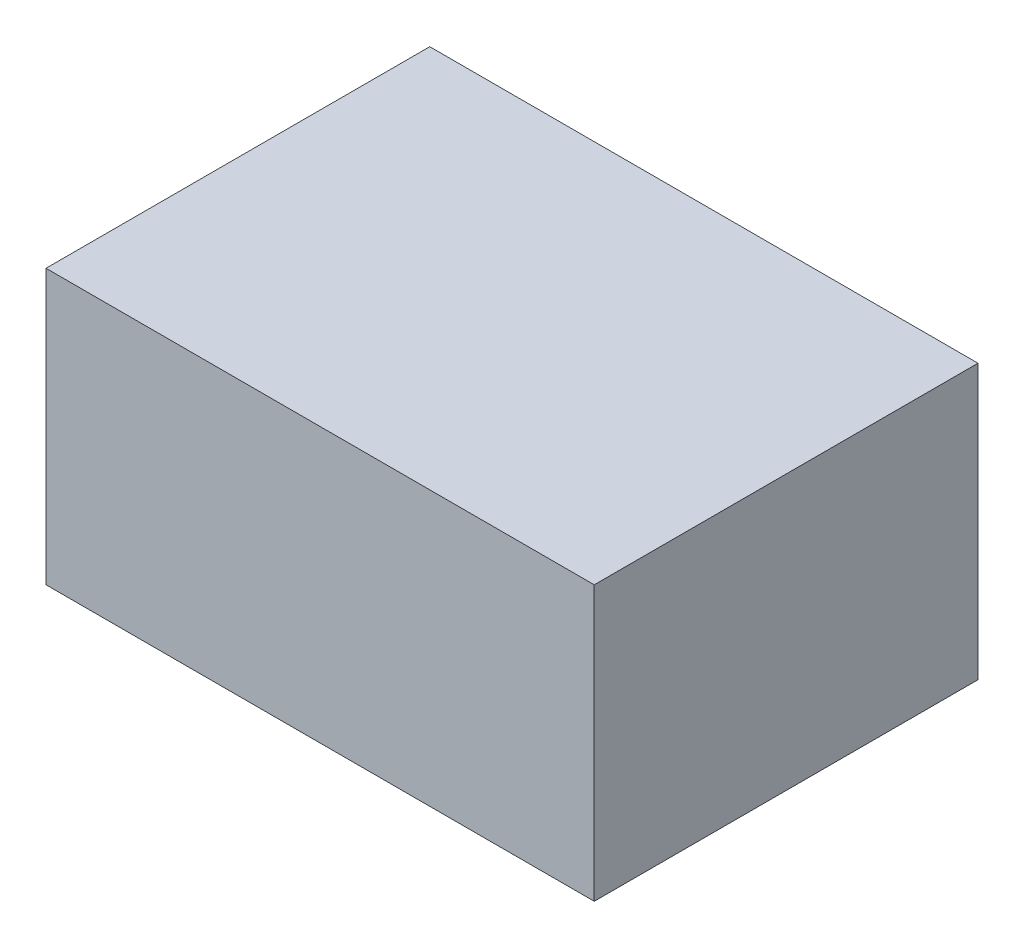
ISO-10303-21;
HEADER;
FILE_DESCRIPTION(('STEP AP214'),'2;1');
FILE_NAME('part.step','',(''),(''),'','','');
FILE_SCHEMA(('AUTOMOTIVE_DESIGN { 1 0 10303 214 1 1 1 1 }'));
ENDSEC;
DATA;
#1=APPLICATION_CONTEXT('core data for automotive mechanical design processes');
#2=APPLICATION_PROTOCOL_DEFINITION('international standard','automotive_design',2000,#1);
#3=PRODUCT_CONTEXT('',#1,'mechanical');
#4=PRODUCT('Part','Part','',(#3));
#5=PRODUCT_RELATED_PRODUCT_CATEGORY('part','',(#4));
#6=PRODUCT_DEFINITION_FORMATION('','',#4);
#7=PRODUCT_DEFINITION_CONTEXT('part definition',#1,'design');
#8=PRODUCT_DEFINITION('design','',#6,#7);
#9=PRODUCT_DEFINITION_SHAPE('','',#8);
#10=(LENGTH_UNIT() NAMED_UNIT(*) SI_UNIT(.MILLI.,.METRE.));
#11=(NAMED_UNIT(*) PLANE_ANGLE_UNIT() SI_UNIT($,.RADIAN.));
#12=(NAMED_UNIT(*) SI_UNIT($,.STERADIAN.) SOLID_ANGLE_UNIT());
#13=UNCERTAINTY_MEASURE_WITH_UNIT(LENGTH_MEASURE(1.E-05),#10,'distance_accuracy_value','');
#14=(GEOMETRIC_REPRESENTATION_CONTEXT(3) GLOBAL_UNCERTAINTY_ASSIGNED_CONTEXT((#13)) GLOBAL_UNIT_ASSIGNED_CONTEXT((#10,
#11,#12)) REPRESENTATION_CONTEXT('',''));
#15=CARTESIAN_POINT('',(0.,0.,0.));
#16=DIRECTION('',(0.,0.,1.));
#17=DIRECTION('',(1.,0.,0.));
#18=AXIS2_PLACEMENT_3D('',#15,#16,#17);
#19=CARTESIAN_POINT('',(0.2499995,0.12500102,0.));
#20=DIRECTION('',(0.,-1.,0.));
#21=DIRECTION('',(0.,0.,-1.));
#22=AXIS2_PLACEMENT_3D('',#19,#20,#21);
#23=PLANE('',#22);
#24=DIRECTION('',(0.,0.,-1.));
#25=VECTOR('',#24,1.);
#26=CARTESIAN_POINT('',(-0.2499995,0.12500102,0.));
#27=LINE('',#26,#25);
#28=CARTESIAN_POINT('',(-0.2499995,0.12500102,0.));
#29=VERTEX_POINT('',#28);
#30=CARTESIAN_POINT('',(-0.2499995,0.12500102,0.3499993));
#31=VERTEX_POINT('',#30);
#32=EDGE_CURVE('E20',#29,#31,#27,.F.);
#33=ORIENTED_EDGE('',*,*,#32,.T.);
#34=DIRECTION('',(-1.,0.,0.));
#35=VECTOR('',#34,1.);
#36=CARTESIAN_POINT('',(-0.2499995,0.12500102,0.3499993));
#37=LINE('',#36,#35);
#38=CARTESIAN_POINT('',(0.2499995,0.12500102,0.3499993));
#39=VERTEX_POINT('',#38);
#40=EDGE_CURVE('E55',#31,#39,#37,.F.);
#41=ORIENTED_EDGE('',*,*,#40,.T.);
#42=DIRECTION('',(0.,0.,1.));
#43=VECTOR('',#42,1.);
#44=CARTESIAN_POINT('',(0.2499995,0.12500102,0.));
#45=LINE('',#44,#43);
#46=CARTESIAN_POINT('',(0.2499995,0.12500102,0.));
#47=VERTEX_POINT('',#46);
#48=EDGE_CURVE('E76',#39,#47,#45,.F.);
#49=ORIENTED_EDGE('',*,*,#48,.T.);
#50=DIRECTION('',(-1.,0.,0.));
#51=VECTOR('',#50,1.);
#52=CARTESIAN_POINT('',(-0.2499995,0.12500102,0.));
#53=LINE('',#52,#51);
#54=EDGE_CURVE('E58',#29,#47,#53,.F.);
#55=ORIENTED_EDGE('',*,*,#54,.F.);
#56=EDGE_LOOP('',(#33,#41,#49,#55));
#57=FACE_BOUND('',#56,.T.);
#58=ADVANCED_FACE('F17',(#57),#23,.F.);
#59=CARTESIAN_POINT('',(-0.2499995,0.12500102,0.));
#60=DIRECTION('',(1.,0.,0.));
#61=DIRECTION('',(0.,0.,-1.));
#62=AXIS2_PLACEMENT_3D('',#59,#60,#61);
#63=PLANE('',#62);
#64=DIRECTION('',(0.,0.,1.));
#65=VECTOR('',#64,1.);
#66=CARTESIAN_POINT('',(-0.2499995,-0.12499848,0.));
#67=LINE('',#66,#65);
#68=CARTESIAN_POINT('',(-0.2499995,-0.12499848,0.));
#69=VERTEX_POINT('',#68);
#70=CARTESIAN_POINT('',(-0.2499995,-0.12499848,0.3499993));
#71=VERTEX_POINT('',#70);
#72=EDGE_CURVE('E73',#69,#71,#67,.T.);
#73=ORIENTED_EDGE('',*,*,#72,.T.);
#74=DIRECTION('',(0.,1.,0.));
#75=VECTOR('',#74,1.);
#76=CARTESIAN_POINT('',(-0.2499995,-0.12499848,0.3499993));
#77=LINE('',#76,#75);
#78=EDGE_CURVE('E63',#71,#31,#77,.T.);
#79=ORIENTED_EDGE('',*,*,#78,.T.);
#80=ORIENTED_EDGE('',*,*,#32,.F.);
#81=DIRECTION('',(0.,1.,0.));
#82=VECTOR('',#81,1.);
#83=CARTESIAN_POINT('',(-0.2499995,-0.12499848,0.));
#84=LINE('',#83,#82);
#85=EDGE_CURVE('E78',#69,#29,#84,.T.);
#86=ORIENTED_EDGE('',*,*,#85,.F.);
#87=EDGE_LOOP('',(#73,#79,#80,#86));
#88=FACE_BOUND('',#87,.T.);
#89=ADVANCED_FACE('F72',(#88),#63,.F.);
#90=CARTESIAN_POINT('',(-0.2499995,-0.12499848,0.3499993));
#91=DIRECTION('',(0.,0.,-1.));
#92=DIRECTION('',(-1.,0.,0.));
#93=AXIS2_PLACEMENT_3D('',#90,#91,#92);
#94=PLANE('',#93);
#95=DIRECTION('',(0.,1.,0.));
#96=VECTOR('',#95,1.);
#97=CARTESIAN_POINT('',(0.2499995,-0.12499848,0.3499993));
#98=LINE('',#97,#96);
#99=CARTESIAN_POINT('',(0.2499995,-0.12499848,0.3499993));
#100=VERTEX_POINT('',#99);
#101=EDGE_CURVE('E69',#100,#39,#98,.T.);
#102=ORIENTED_EDGE('',*,*,#101,.T.);
#103=ORIENTED_EDGE('',*,*,#40,.F.);
#104=ORIENTED_EDGE('',*,*,#78,.F.);
#105=DIRECTION('',(1.,0.,0.));
#106=VECTOR('',#105,1.);
#107=CARTESIAN_POINT('',(-0.2499995,-0.12499848,0.3499993));
#108=LINE('',#107,#106);
#109=EDGE_CURVE('E83',#71,#100,#108,.T.);
#110=ORIENTED_EDGE('',*,*,#109,.T.);
#111=EDGE_LOOP('',(#102,#103,#104,#110));
#112=FACE_BOUND('',#111,.T.);
#113=ADVANCED_FACE('F66',(#112),#94,.F.);
#114=CARTESIAN_POINT('',(0.2499995,-0.12499848,0.));
#115=DIRECTION('',(-1.,0.,0.));
#116=DIRECTION('',(0.,0.,1.));
#117=AXIS2_PLACEMENT_3D('',#114,#115,#116);
#118=PLANE('',#117);
#119=ORIENTED_EDGE('',*,*,#48,.F.);
#120=ORIENTED_EDGE('',*,*,#101,.F.);
#121=DIRECTION('',(0.,0.,1.));
#122=VECTOR('',#121,1.);
#123=CARTESIAN_POINT('',(0.2499995,-0.12499848,0.));
#124=LINE('',#123,#122);
#125=CARTESIAN_POINT('',(0.2499995,-0.12499848,0.));
#126=VERTEX_POINT('',#125);
#127=EDGE_CURVE('E26',#100,#126,#124,.F.);
#128=ORIENTED_EDGE('',*,*,#127,.T.);
#129=DIRECTION('',(0.,1.,0.));
#130=VECTOR('',#129,1.);
#131=CARTESIAN_POINT('',(0.2499995,-0.12499848,0.));
#132=LINE('',#131,#130);
#133=EDGE_CURVE('E34',#47,#126,#132,.F.);
#134=ORIENTED_EDGE('',*,*,#133,.F.);
#135=EDGE_LOOP('',(#119,#120,#128,#134));
#136=FACE_BOUND('',#135,.T.);
#137=ADVANCED_FACE('F88',(#136),#118,.F.);
#138=CARTESIAN_POINT('',(-0.2499995,-0.12499848,0.));
#139=DIRECTION('',(0.,0.,-1.));
#140=DIRECTION('',(-1.,0.,0.));
#141=AXIS2_PLACEMENT_3D('',#138,#139,#140);
#142=PLANE('',#141);
#143=ORIENTED_EDGE('',*,*,#133,.T.);
#144=DIRECTION('',(1.,0.,0.));
#145=VECTOR('',#144,1.);
#146=CARTESIAN_POINT('',(-0.2499995,-0.12499848,0.));
#147=LINE('',#146,#145);
#148=EDGE_CURVE('E11',#126,#69,#147,.F.);
#149=ORIENTED_EDGE('',*,*,#148,.T.);
#150=ORIENTED_EDGE('',*,*,#85,.T.);
#151=ORIENTED_EDGE('',*,*,#54,.T.);
#152=EDGE_LOOP('',(#143,#149,#150,#151));
#153=FACE_BOUND('',#152,.T.);
#154=ADVANCED_FACE('F91',(#153),#142,.T.);
#155=CARTESIAN_POINT('',(-0.2499995,-0.12499848,0.));
#156=DIRECTION('',(0.,1.,0.));
#157=DIRECTION('',(0.,0.,1.));
#158=AXIS2_PLACEMENT_3D('',#155,#156,#157);
#159=PLANE('',#158);
#160=ORIENTED_EDGE('',*,*,#127,.F.);
#161=ORIENTED_EDGE('',*,*,#109,.F.);
#162=ORIENTED_EDGE('',*,*,#72,.F.);
#163=ORIENTED_EDGE('',*,*,#148,.F.);
#164=EDGE_LOOP('',(#160,#161,#162,#163));
#165=FACE_BOUND('',#164,.T.);
#166=ADVANCED_FACE('F90',(#165),#159,.F.);
#167=CLOSED_SHELL('',(#58,#89,#113,#137,#154,#166));
#168=MANIFOLD_SOLID_BREP('B1',#167);
#169=ADVANCED_BREP_SHAPE_REPRESENTATION('',(#18,#168),#14);
#170=SHAPE_DEFINITION_REPRESENTATION(#9,#169);
ENDSEC;
END-ISO-10303-21;
